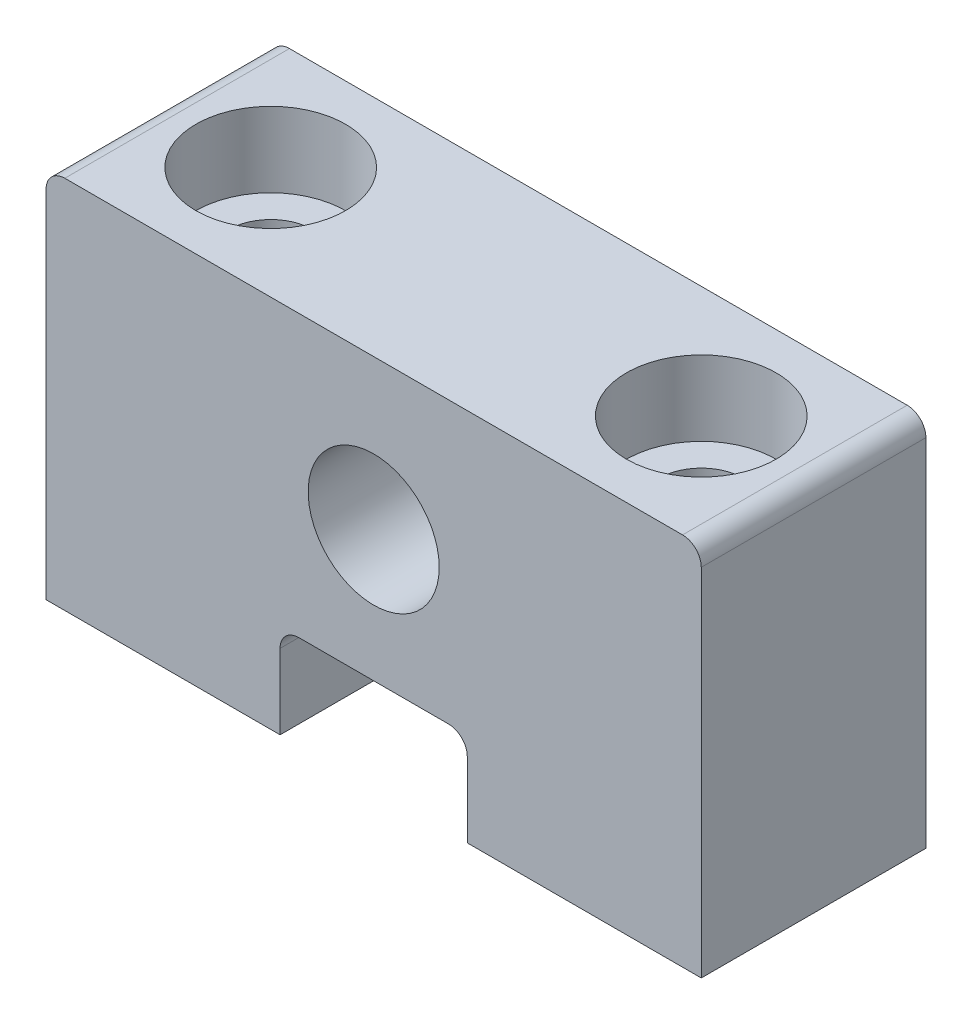
ISO-10303-21;
HEADER;
FILE_DESCRIPTION(('STEP AP214'),'2;1');
FILE_NAME('part.step','',(''),(''),'','','');
FILE_SCHEMA(('AUTOMOTIVE_DESIGN { 1 0 10303 214 1 1 1 1 }'));
ENDSEC;
DATA;
#1=APPLICATION_CONTEXT('core data for automotive mechanical design processes');
#2=APPLICATION_PROTOCOL_DEFINITION('international standard','automotive_design',2000,#1);
#3=PRODUCT_CONTEXT('',#1,'mechanical');
#4=PRODUCT('Part','Part','',(#3));
#5=PRODUCT_RELATED_PRODUCT_CATEGORY('part','',(#4));
#6=PRODUCT_DEFINITION_FORMATION('','',#4);
#7=PRODUCT_DEFINITION_CONTEXT('part definition',#1,'design');
#8=PRODUCT_DEFINITION('design','',#6,#7);
#9=PRODUCT_DEFINITION_SHAPE('','',#8);
#10=(LENGTH_UNIT() NAMED_UNIT(*) SI_UNIT(.MILLI.,.METRE.));
#11=(NAMED_UNIT(*) PLANE_ANGLE_UNIT() SI_UNIT($,.RADIAN.));
#12=(NAMED_UNIT(*) SI_UNIT($,.STERADIAN.) SOLID_ANGLE_UNIT());
#13=UNCERTAINTY_MEASURE_WITH_UNIT(LENGTH_MEASURE(1.E-05),#10,'distance_accuracy_value','');
#14=(GEOMETRIC_REPRESENTATION_CONTEXT(3) GLOBAL_UNCERTAINTY_ASSIGNED_CONTEXT((#13)) GLOBAL_UNIT_ASSIGNED_CONTEXT((#10,
#11,#12)) REPRESENTATION_CONTEXT('',''));
#15=CARTESIAN_POINT('',(0.,0.,0.));
#16=DIRECTION('',(0.,0.,1.));
#17=DIRECTION('',(1.,0.,0.));
#18=AXIS2_PLACEMENT_3D('',#15,#16,#17);
#19=CARTESIAN_POINT('',(0.,0.,12.));
#20=DIRECTION('',(0.,0.,-1.));
#21=DIRECTION('',(-1.,0.,0.));
#22=AXIS2_PLACEMENT_3D('',#19,#20,#21);
#23=PLANE('',#22);
#24=DIRECTION('',(0.,1.,0.));
#25=VECTOR('',#24,1.);
#26=CARTESIAN_POINT('',(17.5,0.,12.));
#27=LINE('',#26,#25);
#28=CARTESIAN_POINT('',(17.5,0.,12.));
#29=VERTEX_POINT('',#28);
#30=CARTESIAN_POINT('',(17.5,19.,12.));
#31=VERTEX_POINT('',#30);
#32=EDGE_CURVE('E180',#29,#31,#27,.T.);
#33=ORIENTED_EDGE('',*,*,#32,.T.);
#34=CARTESIAN_POINT('',(16.5,19.,12.));
#35=DIRECTION('',(0.,0.,-1.));
#36=DIRECTION('',(-1.,0.,0.));
#37=AXIS2_PLACEMENT_3D('',#34,#35,#36);
#38=CIRCLE('',#37,1.);
#39=CARTESIAN_POINT('',(16.5,20.,12.));
#40=VERTEX_POINT('',#39);
#41=EDGE_CURVE('E207',#31,#40,#38,.F.);
#42=ORIENTED_EDGE('',*,*,#41,.T.);
#43=DIRECTION('',(-1.,0.,0.));
#44=VECTOR('',#43,1.);
#45=CARTESIAN_POINT('',(-17.5,20.,12.));
#46=LINE('',#45,#44);
#47=CARTESIAN_POINT('',(-16.5,20.,12.));
#48=VERTEX_POINT('',#47);
#49=EDGE_CURVE('E133',#40,#48,#46,.T.);
#50=ORIENTED_EDGE('',*,*,#49,.T.);
#51=CARTESIAN_POINT('',(-16.5,19.,12.));
#52=DIRECTION('',(0.,0.,-1.));
#53=DIRECTION('',(-1.,0.,0.));
#54=AXIS2_PLACEMENT_3D('',#51,#52,#53);
#55=CIRCLE('',#54,1.);
#56=CARTESIAN_POINT('',(-17.5,19.,12.));
#57=VERTEX_POINT('',#56);
#58=EDGE_CURVE('E50',#48,#57,#55,.F.);
#59=ORIENTED_EDGE('',*,*,#58,.T.);
#60=DIRECTION('',(0.,-1.,0.));
#61=VECTOR('',#60,1.);
#62=CARTESIAN_POINT('',(-17.5,0.,12.));
#63=LINE('',#62,#61);
#64=CARTESIAN_POINT('',(-17.5,0.,12.));
#65=VERTEX_POINT('',#64);
#66=EDGE_CURVE('E123',#57,#65,#63,.T.);
#67=ORIENTED_EDGE('',*,*,#66,.T.);
#68=DIRECTION('',(1.,0.,0.));
#69=VECTOR('',#68,1.);
#70=CARTESIAN_POINT('',(-5.,0.,12.));
#71=LINE('',#70,#69);
#72=CARTESIAN_POINT('',(-5.,0.,12.));
#73=VERTEX_POINT('',#72);
#74=EDGE_CURVE('E128',#65,#73,#71,.T.);
#75=ORIENTED_EDGE('',*,*,#74,.T.);
#76=DIRECTION('',(0.,1.,0.));
#77=VECTOR('',#76,1.);
#78=CARTESIAN_POINT('',(-5.,0.,12.));
#79=LINE('',#78,#77);
#80=CARTESIAN_POINT('',(-5.,4.,12.));
#81=VERTEX_POINT('',#80);
#82=EDGE_CURVE('E148',#73,#81,#79,.T.);
#83=ORIENTED_EDGE('',*,*,#82,.T.);
#84=CARTESIAN_POINT('',(-4.,4.,12.));
#85=DIRECTION('',(0.,0.,-1.));
#86=DIRECTION('',(-1.,0.,0.));
#87=AXIS2_PLACEMENT_3D('',#84,#85,#86);
#88=CIRCLE('',#87,1.);
#89=CARTESIAN_POINT('',(-4.,5.,12.));
#90=VERTEX_POINT('',#89);
#91=EDGE_CURVE('E11',#81,#90,#88,.T.);
#92=ORIENTED_EDGE('',*,*,#91,.T.);
#93=DIRECTION('',(1.,0.,0.));
#94=VECTOR('',#93,1.);
#95=CARTESIAN_POINT('',(-5.,5.,12.));
#96=LINE('',#95,#94);
#97=CARTESIAN_POINT('',(4.,5.00000000000001,12.));
#98=VERTEX_POINT('',#97);
#99=EDGE_CURVE('E150',#90,#98,#96,.T.);
#100=ORIENTED_EDGE('',*,*,#99,.T.);
#101=CARTESIAN_POINT('',(4.,4.00000000000001,12.));
#102=DIRECTION('',(0.,0.,-1.));
#103=DIRECTION('',(-1.,0.,0.));
#104=AXIS2_PLACEMENT_3D('',#101,#102,#103);
#105=CIRCLE('',#104,1.);
#106=CARTESIAN_POINT('',(5.,4.00000000000001,12.));
#107=VERTEX_POINT('',#106);
#108=EDGE_CURVE('E213',#98,#107,#105,.T.);
#109=ORIENTED_EDGE('',*,*,#108,.T.);
#110=DIRECTION('',(0.,-1.,0.));
#111=VECTOR('',#110,1.);
#112=CARTESIAN_POINT('',(5.,0.,12.));
#113=LINE('',#112,#111);
#114=CARTESIAN_POINT('',(5.,0.,12.));
#115=VERTEX_POINT('',#114);
#116=EDGE_CURVE('E156',#107,#115,#113,.T.);
#117=ORIENTED_EDGE('',*,*,#116,.T.);
#118=DIRECTION('',(1.,0.,0.));
#119=VECTOR('',#118,1.);
#120=CARTESIAN_POINT('',(5.,0.,12.));
#121=LINE('',#120,#119);
#122=EDGE_CURVE('E158',#115,#29,#121,.T.);
#123=ORIENTED_EDGE('',*,*,#122,.T.);
#124=EDGE_LOOP('',(#33,#42,#50,#59,#67,#75,#83,#92,#100,#109,#117,#123));
#125=FACE_BOUND('',#124,.T.);
#126=CARTESIAN_POINT('',(0.,12.,12.));
#127=DIRECTION('',(0.,0.,1.));
#128=DIRECTION('',(1.,0.,0.));
#129=AXIS2_PLACEMENT_3D('',#126,#127,#128);
#130=CIRCLE('',#129,3.5);
#131=CARTESIAN_POINT('',(3.5,12.,12.));
#132=VERTEX_POINT('',#131);
#133=EDGE_CURVE('E164',#132,#132,#130,.T.);
#134=ORIENTED_EDGE('',*,*,#133,.F.);
#135=EDGE_LOOP('',(#134));
#136=FACE_BOUND('',#135,.T.);
#137=ADVANCED_FACE('F35',(#125,#136),#23,.F.);
#138=CARTESIAN_POINT('',(0.,0.,0.));
#139=DIRECTION('',(0.,0.,-1.));
#140=DIRECTION('',(-1.,0.,0.));
#141=AXIS2_PLACEMENT_3D('',#138,#139,#140);
#142=PLANE('',#141);
#143=DIRECTION('',(-1.,0.,0.));
#144=VECTOR('',#143,1.);
#145=CARTESIAN_POINT('',(-17.5,20.,0.));
#146=LINE('',#145,#144);
#147=CARTESIAN_POINT('',(16.5,20.,0.));
#148=VERTEX_POINT('',#147);
#149=CARTESIAN_POINT('',(-16.5,20.,0.));
#150=VERTEX_POINT('',#149);
#151=EDGE_CURVE('E163',#148,#150,#146,.T.);
#152=ORIENTED_EDGE('',*,*,#151,.F.);
#153=CARTESIAN_POINT('',(16.5,19.,0.));
#154=DIRECTION('',(0.,0.,-1.));
#155=DIRECTION('',(-1.,0.,0.));
#156=AXIS2_PLACEMENT_3D('',#153,#154,#155);
#157=CIRCLE('',#156,1.);
#158=CARTESIAN_POINT('',(17.5,19.,0.));
#159=VERTEX_POINT('',#158);
#160=EDGE_CURVE('E203',#148,#159,#157,.T.);
#161=ORIENTED_EDGE('',*,*,#160,.T.);
#162=DIRECTION('',(0.,1.,0.));
#163=VECTOR('',#162,1.);
#164=CARTESIAN_POINT('',(17.5,0.,0.));
#165=LINE('',#164,#163);
#166=CARTESIAN_POINT('',(17.5,0.,0.));
#167=VERTEX_POINT('',#166);
#168=EDGE_CURVE('E161',#167,#159,#165,.T.);
#169=ORIENTED_EDGE('',*,*,#168,.F.);
#170=DIRECTION('',(1.,0.,0.));
#171=VECTOR('',#170,1.);
#172=CARTESIAN_POINT('',(5.,0.,0.));
#173=LINE('',#172,#171);
#174=CARTESIAN_POINT('',(5.,0.,0.));
#175=VERTEX_POINT('',#174);
#176=EDGE_CURVE('E178',#175,#167,#173,.T.);
#177=ORIENTED_EDGE('',*,*,#176,.F.);
#178=DIRECTION('',(0.,-1.,0.));
#179=VECTOR('',#178,1.);
#180=CARTESIAN_POINT('',(5.,0.,0.));
#181=LINE('',#180,#179);
#182=CARTESIAN_POINT('',(5.,4.00000000000001,0.));
#183=VERTEX_POINT('',#182);
#184=EDGE_CURVE('E176',#183,#175,#181,.T.);
#185=ORIENTED_EDGE('',*,*,#184,.F.);
#186=CARTESIAN_POINT('',(4.,4.00000000000001,0.));
#187=DIRECTION('',(0.,0.,-1.));
#188=DIRECTION('',(-1.,0.,0.));
#189=AXIS2_PLACEMENT_3D('',#186,#187,#188);
#190=CIRCLE('',#189,1.);
#191=CARTESIAN_POINT('',(4.,5.00000000000001,0.));
#192=VERTEX_POINT('',#191);
#193=EDGE_CURVE('E211',#183,#192,#190,.F.);
#194=ORIENTED_EDGE('',*,*,#193,.T.);
#195=DIRECTION('',(1.,0.,0.));
#196=VECTOR('',#195,1.);
#197=CARTESIAN_POINT('',(-5.,5.,0.));
#198=LINE('',#197,#196);
#199=CARTESIAN_POINT('',(-4.,5.,0.));
#200=VERTEX_POINT('',#199);
#201=EDGE_CURVE('E173',#200,#192,#198,.T.);
#202=ORIENTED_EDGE('',*,*,#201,.F.);
#203=CARTESIAN_POINT('',(-4.,4.,0.));
#204=DIRECTION('',(0.,0.,-1.));
#205=DIRECTION('',(-1.,0.,0.));
#206=AXIS2_PLACEMENT_3D('',#203,#204,#205);
#207=CIRCLE('',#206,1.);
#208=CARTESIAN_POINT('',(-5.,4.,0.));
#209=VERTEX_POINT('',#208);
#210=EDGE_CURVE('E43',#200,#209,#207,.F.);
#211=ORIENTED_EDGE('',*,*,#210,.T.);
#212=DIRECTION('',(0.,1.,0.));
#213=VECTOR('',#212,1.);
#214=CARTESIAN_POINT('',(-5.,0.,0.));
#215=LINE('',#214,#213);
#216=CARTESIAN_POINT('',(-5.,0.,0.));
#217=VERTEX_POINT('',#216);
#218=EDGE_CURVE('E170',#217,#209,#215,.T.);
#219=ORIENTED_EDGE('',*,*,#218,.F.);
#220=DIRECTION('',(1.,0.,0.));
#221=VECTOR('',#220,1.);
#222=CARTESIAN_POINT('',(-5.,0.,0.));
#223=LINE('',#222,#221);
#224=CARTESIAN_POINT('',(-17.5,0.,0.));
#225=VERTEX_POINT('',#224);
#226=EDGE_CURVE('E168',#225,#217,#223,.T.);
#227=ORIENTED_EDGE('',*,*,#226,.F.);
#228=DIRECTION('',(0.,-1.,0.));
#229=VECTOR('',#228,1.);
#230=CARTESIAN_POINT('',(-17.5,0.,0.));
#231=LINE('',#230,#229);
#232=CARTESIAN_POINT('',(-17.5,19.,0.));
#233=VERTEX_POINT('',#232);
#234=EDGE_CURVE('E139',#233,#225,#231,.T.);
#235=ORIENTED_EDGE('',*,*,#234,.F.);
#236=CARTESIAN_POINT('',(-16.5,19.,0.));
#237=DIRECTION('',(0.,0.,-1.));
#238=DIRECTION('',(-1.,0.,0.));
#239=AXIS2_PLACEMENT_3D('',#236,#237,#238);
#240=CIRCLE('',#239,1.);
#241=EDGE_CURVE('E201',#233,#150,#240,.T.);
#242=ORIENTED_EDGE('',*,*,#241,.T.);
#243=EDGE_LOOP('',(#152,#161,#169,#177,#185,#194,#202,#211,#219,#227,#235,#242));
#244=FACE_BOUND('',#243,.T.);
#245=CARTESIAN_POINT('',(0.,12.,0.));
#246=DIRECTION('',(0.,0.,1.));
#247=DIRECTION('',(1.,0.,0.));
#248=AXIS2_PLACEMENT_3D('',#245,#246,#247);
#249=CIRCLE('',#248,3.5);
#250=CARTESIAN_POINT('',(3.5,12.,0.));
#251=VERTEX_POINT('',#250);
#252=EDGE_CURVE('E257',#251,#251,#249,.T.);
#253=ORIENTED_EDGE('',*,*,#252,.T.);
#254=EDGE_LOOP('',(#253));
#255=FACE_BOUND('',#254,.T.);
#256=ADVANCED_FACE('F218',(#244,#255),#142,.T.);
#257=CARTESIAN_POINT('',(17.5,0.,12.));
#258=DIRECTION('',(-1.,0.,0.));
#259=DIRECTION('',(0.,0.,1.));
#260=AXIS2_PLACEMENT_3D('',#257,#258,#259);
#261=PLANE('',#260);
#262=ORIENTED_EDGE('',*,*,#168,.T.);
#263=DIRECTION('',(0.,0.,-1.));
#264=VECTOR('',#263,1.);
#265=CARTESIAN_POINT('',(17.5,19.,12.));
#266=LINE('',#265,#264);
#267=EDGE_CURVE('E58',#159,#31,#266,.F.);
#268=ORIENTED_EDGE('',*,*,#267,.T.);
#269=ORIENTED_EDGE('',*,*,#32,.F.);
#270=DIRECTION('',(0.,0.,-1.));
#271=VECTOR('',#270,1.);
#272=CARTESIAN_POINT('',(17.5,0.,12.));
#273=LINE('',#272,#271);
#274=EDGE_CURVE('E160',#29,#167,#273,.T.);
#275=ORIENTED_EDGE('',*,*,#274,.T.);
#276=EDGE_LOOP('',(#262,#268,#269,#275));
#277=FACE_BOUND('',#276,.T.);
#278=ADVANCED_FACE('F291',(#277),#261,.F.);
#279=CARTESIAN_POINT('',(-17.5,20.,12.));
#280=DIRECTION('',(0.,-1.,0.));
#281=DIRECTION('',(0.,0.,-1.));
#282=AXIS2_PLACEMENT_3D('',#279,#280,#281);
#283=PLANE('',#282);
#284=CARTESIAN_POINT('',(-11.5,20.,6.));
#285=DIRECTION('',(0.,1.,0.));
#286=DIRECTION('',(0.,0.,1.));
#287=AXIS2_PLACEMENT_3D('',#284,#285,#286);
#288=CIRCLE('',#287,4.);
#289=CARTESIAN_POINT('',(-11.5,20.,10.));
#290=VERTEX_POINT('',#289);
#291=EDGE_CURVE('E283',#290,#290,#288,.T.);
#292=ORIENTED_EDGE('',*,*,#291,.F.);
#293=EDGE_LOOP('',(#292));
#294=FACE_BOUND('',#293,.T.);
#295=CARTESIAN_POINT('',(11.5,20.,6.));
#296=DIRECTION('',(0.,1.,0.));
#297=DIRECTION('',(0.,0.,1.));
#298=AXIS2_PLACEMENT_3D('',#295,#296,#297);
#299=CIRCLE('',#298,4.);
#300=CARTESIAN_POINT('',(11.5,20.,10.));
#301=VERTEX_POINT('',#300);
#302=EDGE_CURVE('E271',#301,#301,#299,.T.);
#303=ORIENTED_EDGE('',*,*,#302,.F.);
#304=EDGE_LOOP('',(#303));
#305=FACE_BOUND('',#304,.T.);
#306=ORIENTED_EDGE('',*,*,#49,.F.);
#307=DIRECTION('',(0.,0.,-1.));
#308=VECTOR('',#307,1.);
#309=CARTESIAN_POINT('',(16.5,20.,12.));
#310=LINE('',#309,#308);
#311=EDGE_CURVE('E198',#40,#148,#310,.T.);
#312=ORIENTED_EDGE('',*,*,#311,.T.);
#313=ORIENTED_EDGE('',*,*,#151,.T.);
#314=DIRECTION('',(0.,0.,-1.));
#315=VECTOR('',#314,1.);
#316=CARTESIAN_POINT('',(-16.5,20.,12.));
#317=LINE('',#316,#315);
#318=EDGE_CURVE('E196',#150,#48,#317,.F.);
#319=ORIENTED_EDGE('',*,*,#318,.T.);
#320=EDGE_LOOP('',(#306,#312,#313,#319));
#321=FACE_BOUND('',#320,.T.);
#322=ADVANCED_FACE('F252',(#294,#305,#321),#283,.F.);
#323=CARTESIAN_POINT('',(-17.5,0.,12.));
#324=DIRECTION('',(1.,0.,0.));
#325=DIRECTION('',(0.,0.,-1.));
#326=AXIS2_PLACEMENT_3D('',#323,#324,#325);
#327=PLANE('',#326);
#328=ORIENTED_EDGE('',*,*,#66,.F.);
#329=DIRECTION('',(0.,0.,-1.));
#330=VECTOR('',#329,1.);
#331=CARTESIAN_POINT('',(-17.5,19.,12.));
#332=LINE('',#331,#330);
#333=EDGE_CURVE('E209',#57,#233,#332,.T.);
#334=ORIENTED_EDGE('',*,*,#333,.T.);
#335=ORIENTED_EDGE('',*,*,#234,.T.);
#336=DIRECTION('',(0.,0.,-1.));
#337=VECTOR('',#336,1.);
#338=CARTESIAN_POINT('',(-17.5,0.,12.));
#339=LINE('',#338,#337);
#340=EDGE_CURVE('E136',#65,#225,#339,.T.);
#341=ORIENTED_EDGE('',*,*,#340,.F.);
#342=EDGE_LOOP('',(#328,#334,#335,#341));
#343=FACE_BOUND('',#342,.T.);
#344=ADVANCED_FACE('F137',(#343),#327,.F.);
#345=CARTESIAN_POINT('',(-5.,0.,12.));
#346=DIRECTION('',(0.,1.,0.));
#347=DIRECTION('',(-1.,0.,0.));
#348=AXIS2_PLACEMENT_3D('',#345,#346,#347);
#349=PLANE('',#348);
#350=CARTESIAN_POINT('',(-11.5,0.,6.));
#351=DIRECTION('',(0.,1.,0.));
#352=DIRECTION('',(0.,0.,1.));
#353=AXIS2_PLACEMENT_3D('',#350,#351,#352);
#354=CIRCLE('',#353,2.25);
#355=CARTESIAN_POINT('',(-11.5,0.,8.24999999999999));
#356=VERTEX_POINT('',#355);
#357=EDGE_CURVE('E274',#356,#356,#354,.T.);
#358=ORIENTED_EDGE('',*,*,#357,.T.);
#359=EDGE_LOOP('',(#358));
#360=FACE_BOUND('',#359,.T.);
#361=ORIENTED_EDGE('',*,*,#226,.T.);
#362=DIRECTION('',(0.,0.,-1.));
#363=VECTOR('',#362,1.);
#364=CARTESIAN_POINT('',(-5.,0.,12.));
#365=LINE('',#364,#363);
#366=EDGE_CURVE('E143',#73,#217,#365,.T.);
#367=ORIENTED_EDGE('',*,*,#366,.F.);
#368=ORIENTED_EDGE('',*,*,#74,.F.);
#369=ORIENTED_EDGE('',*,*,#340,.T.);
#370=EDGE_LOOP('',(#361,#367,#368,#369));
#371=FACE_BOUND('',#370,.T.);
#372=ADVANCED_FACE('F145',(#360,#371),#349,.F.);
#373=CARTESIAN_POINT('',(-5.,0.,12.));
#374=DIRECTION('',(-1.,0.,0.));
#375=DIRECTION('',(0.,-1.,0.));
#376=AXIS2_PLACEMENT_3D('',#373,#374,#375);
#377=PLANE('',#376);
#378=ORIENTED_EDGE('',*,*,#218,.T.);
#379=DIRECTION('',(0.,0.,-1.));
#380=VECTOR('',#379,1.);
#381=CARTESIAN_POINT('',(-5.,4.,12.));
#382=LINE('',#381,#380);
#383=EDGE_CURVE('E194',#209,#81,#382,.F.);
#384=ORIENTED_EDGE('',*,*,#383,.T.);
#385=ORIENTED_EDGE('',*,*,#82,.F.);
#386=ORIENTED_EDGE('',*,*,#366,.T.);
#387=EDGE_LOOP('',(#378,#384,#385,#386));
#388=FACE_BOUND('',#387,.T.);
#389=ADVANCED_FACE('F224',(#388),#377,.F.);
#390=CARTESIAN_POINT('',(-5.,5.,12.));
#391=DIRECTION('',(0.,1.,0.));
#392=DIRECTION('',(-1.,0.,0.));
#393=AXIS2_PLACEMENT_3D('',#390,#391,#392);
#394=PLANE('',#393);
#395=ORIENTED_EDGE('',*,*,#201,.T.);
#396=DIRECTION('',(0.,0.,-1.));
#397=VECTOR('',#396,1.);
#398=CARTESIAN_POINT('',(4.,5.00000000000001,12.));
#399=LINE('',#398,#397);
#400=EDGE_CURVE('E192',#192,#98,#399,.F.);
#401=ORIENTED_EDGE('',*,*,#400,.T.);
#402=ORIENTED_EDGE('',*,*,#99,.F.);
#403=DIRECTION('',(0.,0.,-1.));
#404=VECTOR('',#403,1.);
#405=CARTESIAN_POINT('',(-4.,5.,0.));
#406=LINE('',#405,#404);
#407=EDGE_CURVE('E189',#90,#200,#406,.T.);
#408=ORIENTED_EDGE('',*,*,#407,.T.);
#409=EDGE_LOOP('',(#395,#401,#402,#408));
#410=FACE_BOUND('',#409,.T.);
#411=ADVANCED_FACE('F230',(#410),#394,.F.);
#412=CARTESIAN_POINT('',(5.,0.,12.));
#413=DIRECTION('',(1.,0.,0.));
#414=DIRECTION('',(0.,1.,0.));
#415=AXIS2_PLACEMENT_3D('',#412,#413,#414);
#416=PLANE('',#415);
#417=ORIENTED_EDGE('',*,*,#116,.F.);
#418=DIRECTION('',(0.,0.,-1.));
#419=VECTOR('',#418,1.);
#420=CARTESIAN_POINT('',(5.,4.00000000000001,0.));
#421=LINE('',#420,#419);
#422=EDGE_CURVE('E142',#107,#183,#421,.T.);
#423=ORIENTED_EDGE('',*,*,#422,.T.);
#424=ORIENTED_EDGE('',*,*,#184,.T.);
#425=DIRECTION('',(0.,0.,-1.));
#426=VECTOR('',#425,1.);
#427=CARTESIAN_POINT('',(5.,0.,12.));
#428=LINE('',#427,#426);
#429=EDGE_CURVE('E183',#115,#175,#428,.T.);
#430=ORIENTED_EDGE('',*,*,#429,.F.);
#431=EDGE_LOOP('',(#417,#423,#424,#430));
#432=FACE_BOUND('',#431,.T.);
#433=ADVANCED_FACE('F238',(#432),#416,.F.);
#434=CARTESIAN_POINT('',(5.,0.,12.));
#435=DIRECTION('',(0.,1.,0.));
#436=DIRECTION('',(-1.,0.,0.));
#437=AXIS2_PLACEMENT_3D('',#434,#435,#436);
#438=PLANE('',#437);
#439=CARTESIAN_POINT('',(11.5,0.,6.));
#440=DIRECTION('',(0.,1.,0.));
#441=DIRECTION('',(0.,0.,1.));
#442=AXIS2_PLACEMENT_3D('',#439,#440,#441);
#443=CIRCLE('',#442,2.25);
#444=CARTESIAN_POINT('',(11.5,0.,8.24999999999999));
#445=VERTEX_POINT('',#444);
#446=EDGE_CURVE('E260',#445,#445,#443,.T.);
#447=ORIENTED_EDGE('',*,*,#446,.T.);
#448=EDGE_LOOP('',(#447));
#449=FACE_BOUND('',#448,.T.);
#450=ORIENTED_EDGE('',*,*,#176,.T.);
#451=ORIENTED_EDGE('',*,*,#274,.F.);
#452=ORIENTED_EDGE('',*,*,#122,.F.);
#453=ORIENTED_EDGE('',*,*,#429,.T.);
#454=EDGE_LOOP('',(#450,#451,#452,#453));
#455=FACE_BOUND('',#454,.T.);
#456=ADVANCED_FACE('F244',(#449,#455),#438,.F.);
#457=CARTESIAN_POINT('',(0.,12.,12.));
#458=DIRECTION('',(0.,0.,-1.));
#459=DIRECTION('',(-1.,0.,0.));
#460=AXIS2_PLACEMENT_3D('',#457,#458,#459);
#461=CYLINDRICAL_SURFACE('',#460,3.5);
#462=ORIENTED_EDGE('',*,*,#133,.T.);
#463=EDGE_LOOP('',(#462));
#464=FACE_BOUND('',#463,.T.);
#465=ORIENTED_EDGE('',*,*,#252,.F.);
#466=EDGE_LOOP('',(#465));
#467=FACE_BOUND('',#466,.T.);
#468=ADVANCED_FACE('F319',(#464,#467),#461,.F.);
#469=CARTESIAN_POINT('',(11.5,20.,6.));
#470=DIRECTION('',(0.,1.,0.));
#471=DIRECTION('',(0.,0.,1.));
#472=AXIS2_PLACEMENT_3D('',#469,#470,#471);
#473=CYLINDRICAL_SURFACE('',#472,2.25);
#474=ORIENTED_EDGE('',*,*,#446,.F.);
#475=EDGE_LOOP('',(#474));
#476=FACE_BOUND('',#475,.T.);
#477=CARTESIAN_POINT('',(11.5,16.,6.));
#478=DIRECTION('',(0.,1.,0.));
#479=DIRECTION('',(0.,0.,1.));
#480=AXIS2_PLACEMENT_3D('',#477,#478,#479);
#481=CIRCLE('',#480,2.25);
#482=CARTESIAN_POINT('',(11.5,16.,8.25));
#483=VERTEX_POINT('',#482);
#484=EDGE_CURVE('E265',#483,#483,#481,.T.);
#485=ORIENTED_EDGE('',*,*,#484,.T.);
#486=EDGE_LOOP('',(#485));
#487=FACE_BOUND('',#486,.T.);
#488=ADVANCED_FACE('F308',(#476,#487),#473,.F.);
#489=CARTESIAN_POINT('',(13.75,16.,6.));
#490=DIRECTION('',(0.,-1.,0.));
#491=DIRECTION('',(0.,0.,-1.));
#492=AXIS2_PLACEMENT_3D('',#489,#490,#491);
#493=PLANE('',#492);
#494=ORIENTED_EDGE('',*,*,#484,.F.);
#495=EDGE_LOOP('',(#494));
#496=FACE_BOUND('',#495,.T.);
#497=CARTESIAN_POINT('',(11.5,16.,6.));
#498=DIRECTION('',(0.,1.,0.));
#499=DIRECTION('',(0.,0.,1.));
#500=AXIS2_PLACEMENT_3D('',#497,#498,#499);
#501=CIRCLE('',#500,4.);
#502=CARTESIAN_POINT('',(11.5,16.,10.));
#503=VERTEX_POINT('',#502);
#504=EDGE_CURVE('E268',#503,#503,#501,.T.);
#505=ORIENTED_EDGE('',*,*,#504,.T.);
#506=EDGE_LOOP('',(#505));
#507=FACE_BOUND('',#506,.T.);
#508=ADVANCED_FACE('F298',(#496,#507),#493,.F.);
#509=CARTESIAN_POINT('',(11.5,20.,6.));
#510=DIRECTION('',(0.,1.,0.));
#511=DIRECTION('',(0.,0.,1.));
#512=AXIS2_PLACEMENT_3D('',#509,#510,#511);
#513=CYLINDRICAL_SURFACE('',#512,4.);
#514=ORIENTED_EDGE('',*,*,#504,.F.);
#515=EDGE_LOOP('',(#514));
#516=FACE_BOUND('',#515,.T.);
#517=ORIENTED_EDGE('',*,*,#302,.T.);
#518=EDGE_LOOP('',(#517));
#519=FACE_BOUND('',#518,.T.);
#520=ADVANCED_FACE('F295',(#516,#519),#513,.F.);
#521=CARTESIAN_POINT('',(-11.5,20.,6.));
#522=DIRECTION('',(0.,1.,0.));
#523=DIRECTION('',(0.,0.,1.));
#524=AXIS2_PLACEMENT_3D('',#521,#522,#523);
#525=CYLINDRICAL_SURFACE('',#524,2.25);
#526=ORIENTED_EDGE('',*,*,#357,.F.);
#527=EDGE_LOOP('',(#526));
#528=FACE_BOUND('',#527,.T.);
#529=CARTESIAN_POINT('',(-11.5,16.,6.));
#530=DIRECTION('',(0.,1.,0.));
#531=DIRECTION('',(0.,0.,1.));
#532=AXIS2_PLACEMENT_3D('',#529,#530,#531);
#533=CIRCLE('',#532,2.25);
#534=CARTESIAN_POINT('',(-11.5,16.,8.25));
#535=VERTEX_POINT('',#534);
#536=EDGE_CURVE('E277',#535,#535,#533,.T.);
#537=ORIENTED_EDGE('',*,*,#536,.T.);
#538=EDGE_LOOP('',(#537));
#539=FACE_BOUND('',#538,.T.);
#540=ADVANCED_FACE('F297',(#528,#539),#525,.F.);
#541=CARTESIAN_POINT('',(-9.25,16.,6.));
#542=DIRECTION('',(0.,-1.,0.));
#543=DIRECTION('',(0.,0.,-1.));
#544=AXIS2_PLACEMENT_3D('',#541,#542,#543);
#545=PLANE('',#544);
#546=ORIENTED_EDGE('',*,*,#536,.F.);
#547=EDGE_LOOP('',(#546));
#548=FACE_BOUND('',#547,.T.);
#549=CARTESIAN_POINT('',(-11.5,16.,6.));
#550=DIRECTION('',(0.,1.,0.));
#551=DIRECTION('',(0.,0.,1.));
#552=AXIS2_PLACEMENT_3D('',#549,#550,#551);
#553=CIRCLE('',#552,4.);
#554=CARTESIAN_POINT('',(-11.5,16.,10.));
#555=VERTEX_POINT('',#554);
#556=EDGE_CURVE('E280',#555,#555,#553,.T.);
#557=ORIENTED_EDGE('',*,*,#556,.T.);
#558=EDGE_LOOP('',(#557));
#559=FACE_BOUND('',#558,.T.);
#560=ADVANCED_FACE('F305',(#548,#559),#545,.F.);
#561=CARTESIAN_POINT('',(-11.5,20.,6.));
#562=DIRECTION('',(0.,1.,0.));
#563=DIRECTION('',(0.,0.,1.));
#564=AXIS2_PLACEMENT_3D('',#561,#562,#563);
#565=CYLINDRICAL_SURFACE('',#564,4.);
#566=ORIENTED_EDGE('',*,*,#556,.F.);
#567=EDGE_LOOP('',(#566));
#568=FACE_BOUND('',#567,.T.);
#569=ORIENTED_EDGE('',*,*,#291,.T.);
#570=EDGE_LOOP('',(#569));
#571=FACE_BOUND('',#570,.T.);
#572=ADVANCED_FACE('F287',(#568,#571),#565,.F.);
#573=CARTESIAN_POINT('',(4.,4.00000000000001,12.));
#574=DIRECTION('',(0.,0.,1.));
#575=DIRECTION('',(1.,0.,0.));
#576=AXIS2_PLACEMENT_3D('',#573,#574,#575);
#577=CYLINDRICAL_SURFACE('',#576,1.);
#578=ORIENTED_EDGE('',*,*,#108,.F.);
#579=ORIENTED_EDGE('',*,*,#400,.F.);
#580=ORIENTED_EDGE('',*,*,#193,.F.);
#581=ORIENTED_EDGE('',*,*,#422,.F.);
#582=EDGE_LOOP('',(#578,#579,#580,#581));
#583=FACE_BOUND('',#582,.T.);
#584=ADVANCED_FACE('F233',(#583),#577,.F.);
#585=CARTESIAN_POINT('',(-4.,4.,12.));
#586=DIRECTION('',(0.,0.,1.));
#587=DIRECTION('',(1.,0.,0.));
#588=AXIS2_PLACEMENT_3D('',#585,#586,#587);
#589=CYLINDRICAL_SURFACE('',#588,1.);
#590=ORIENTED_EDGE('',*,*,#91,.F.);
#591=ORIENTED_EDGE('',*,*,#383,.F.);
#592=ORIENTED_EDGE('',*,*,#210,.F.);
#593=ORIENTED_EDGE('',*,*,#407,.F.);
#594=EDGE_LOOP('',(#590,#591,#592,#593));
#595=FACE_BOUND('',#594,.T.);
#596=ADVANCED_FACE('F226',(#595),#589,.F.);
#597=CARTESIAN_POINT('',(16.5,19.,12.));
#598=DIRECTION('',(0.,0.,-1.));
#599=DIRECTION('',(-1.,0.,0.));
#600=AXIS2_PLACEMENT_3D('',#597,#598,#599);
#601=CYLINDRICAL_SURFACE('',#600,1.);
#602=ORIENTED_EDGE('',*,*,#41,.F.);
#603=ORIENTED_EDGE('',*,*,#267,.F.);
#604=ORIENTED_EDGE('',*,*,#160,.F.);
#605=ORIENTED_EDGE('',*,*,#311,.F.);
#606=EDGE_LOOP('',(#602,#603,#604,#605));
#607=FACE_BOUND('',#606,.T.);
#608=ADVANCED_FACE('F250',(#607),#601,.T.);
#609=CARTESIAN_POINT('',(-16.5,19.,12.));
#610=DIRECTION('',(0.,0.,-1.));
#611=DIRECTION('',(-1.,0.,0.));
#612=AXIS2_PLACEMENT_3D('',#609,#610,#611);
#613=CYLINDRICAL_SURFACE('',#612,1.);
#614=ORIENTED_EDGE('',*,*,#58,.F.);
#615=ORIENTED_EDGE('',*,*,#318,.F.);
#616=ORIENTED_EDGE('',*,*,#241,.F.);
#617=ORIENTED_EDGE('',*,*,#333,.F.);
#618=EDGE_LOOP('',(#614,#615,#616,#617));
#619=FACE_BOUND('',#618,.T.);
#620=ADVANCED_FACE('F37',(#619),#613,.T.);
#621=CLOSED_SHELL('',(#137,#256,#278,#322,#344,#372,#389,#411,#433,#456,#468,#488,#508,#520,
#540,#560,#572,#584,#596,#608,#620));
#622=MANIFOLD_SOLID_BREP('B2',#621);
#623=ADVANCED_BREP_SHAPE_REPRESENTATION('',(#18,#622),#14);
#624=SHAPE_DEFINITION_REPRESENTATION(#9,#623);
ENDSEC;
END-ISO-10303-21;
